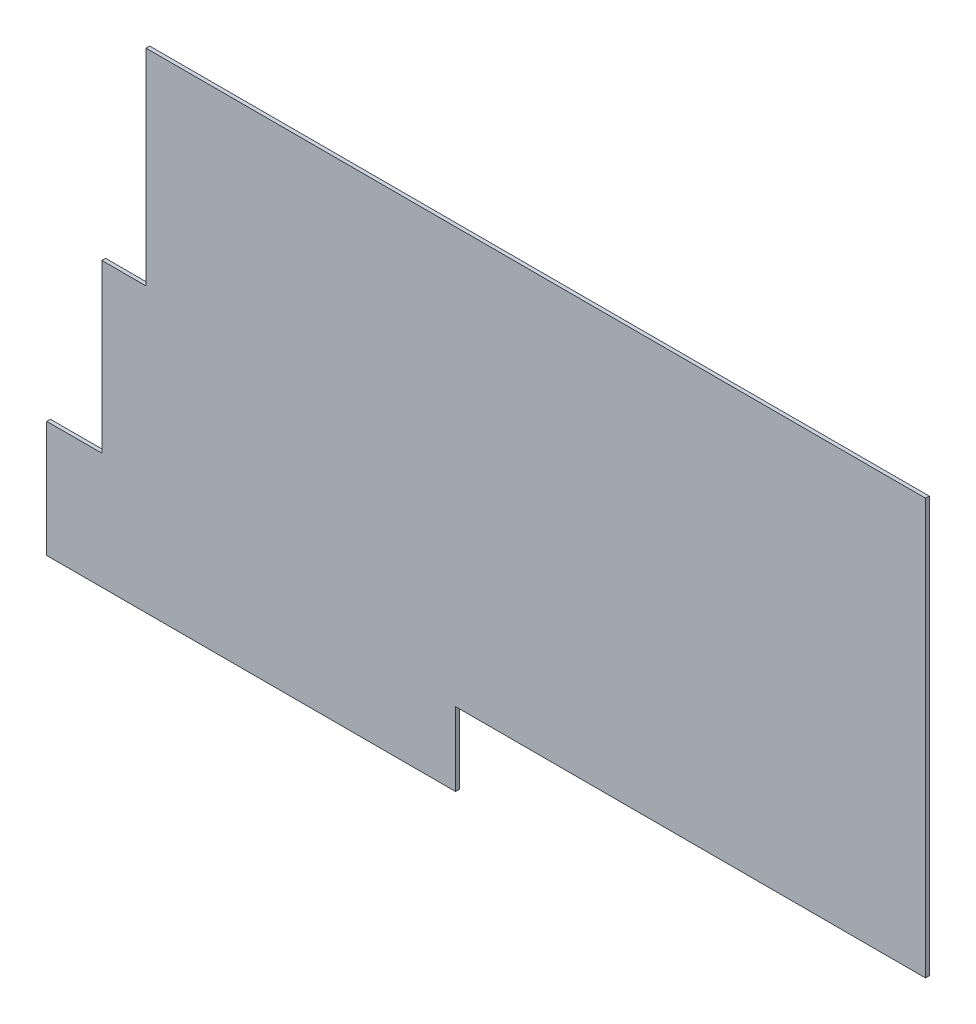
ISO-10303-21;
HEADER;
FILE_DESCRIPTION(('STEP AP214'),'2;1');
FILE_NAME('part.step','',(''),(''),'','','');
FILE_SCHEMA(('AUTOMOTIVE_DESIGN { 1 0 10303 214 1 1 1 1 }'));
ENDSEC;
DATA;
#1=APPLICATION_CONTEXT('core data for automotive mechanical design processes');
#2=APPLICATION_PROTOCOL_DEFINITION('international standard','automotive_design',2000,#1);
#3=PRODUCT_CONTEXT('',#1,'mechanical');
#4=PRODUCT('Part','Part','',(#3));
#5=PRODUCT_RELATED_PRODUCT_CATEGORY('part','',(#4));
#6=PRODUCT_DEFINITION_FORMATION('','',#4);
#7=PRODUCT_DEFINITION_CONTEXT('part definition',#1,'design');
#8=PRODUCT_DEFINITION('design','',#6,#7);
#9=PRODUCT_DEFINITION_SHAPE('','',#8);
#10=(LENGTH_UNIT() NAMED_UNIT(*) SI_UNIT(.MILLI.,.METRE.));
#11=(NAMED_UNIT(*) PLANE_ANGLE_UNIT() SI_UNIT($,.RADIAN.));
#12=(NAMED_UNIT(*) SI_UNIT($,.STERADIAN.) SOLID_ANGLE_UNIT());
#13=UNCERTAINTY_MEASURE_WITH_UNIT(LENGTH_MEASURE(1.E-05),#10,'distance_accuracy_value','');
#14=(GEOMETRIC_REPRESENTATION_CONTEXT(3) GLOBAL_UNCERTAINTY_ASSIGNED_CONTEXT((#13)) GLOBAL_UNIT_ASSIGNED_CONTEXT((#10,
#11,#12)) REPRESENTATION_CONTEXT('',''));
#15=CARTESIAN_POINT('',(0.,0.,0.));
#16=DIRECTION('',(0.,0.,1.));
#17=DIRECTION('',(1.,0.,0.));
#18=AXIS2_PLACEMENT_3D('',#15,#16,#17);
#19=CARTESIAN_POINT('',(-3420.,-2170.,50.));
#20=DIRECTION('',(1.,0.,0.));
#21=DIRECTION('',(0.,0.,-1.));
#22=AXIS2_PLACEMENT_3D('',#19,#20,#21);
#23=PLANE('',#22);
#24=DIRECTION('',(0.,-1.,0.));
#25=VECTOR('',#24,1.);
#26=CARTESIAN_POINT('',(-3420.,-2170.,0.));
#27=LINE('',#26,#25);
#28=CARTESIAN_POINT('',(-3420.,-2170.,0.));
#29=VERTEX_POINT('',#28);
#30=CARTESIAN_POINT('',(-3420.,-3750.,0.));
#31=VERTEX_POINT('',#30);
#32=EDGE_CURVE('E142',#29,#31,#27,.T.);
#33=ORIENTED_EDGE('',*,*,#32,.T.);
#34=DIRECTION('',(0.,0.,-1.));
#35=VECTOR('',#34,1.);
#36=CARTESIAN_POINT('',(-3420.,-3750.,50.));
#37=LINE('',#36,#35);
#38=CARTESIAN_POINT('',(-3420.,-3750.,50.));
#39=VERTEX_POINT('',#38);
#40=EDGE_CURVE('E11',#39,#31,#37,.T.);
#41=ORIENTED_EDGE('',*,*,#40,.F.);
#42=DIRECTION('',(0.,-1.,0.));
#43=VECTOR('',#42,1.);
#44=CARTESIAN_POINT('',(-3420.,-2170.,50.));
#45=LINE('',#44,#43);
#46=CARTESIAN_POINT('',(-3420.,-2170.,50.));
#47=VERTEX_POINT('',#46);
#48=EDGE_CURVE('E160',#47,#39,#45,.T.);
#49=ORIENTED_EDGE('',*,*,#48,.F.);
#50=DIRECTION('',(0.,0.,-1.));
#51=VECTOR('',#50,1.);
#52=CARTESIAN_POINT('',(-3420.,-2170.,50.));
#53=LINE('',#52,#51);
#54=EDGE_CURVE('E138',#47,#29,#53,.T.);
#55=ORIENTED_EDGE('',*,*,#54,.T.);
#56=EDGE_LOOP('',(#33,#41,#49,#55));
#57=FACE_BOUND('',#56,.T.);
#58=ADVANCED_FACE('F34',(#57),#23,.F.);
#59=CARTESIAN_POINT('',(-3420.,-3750.,50.));
#60=DIRECTION('',(0.,1.,0.));
#61=DIRECTION('',(0.,0.,1.));
#62=AXIS2_PLACEMENT_3D('',#59,#60,#61);
#63=PLANE('',#62);
#64=DIRECTION('',(1.,0.,0.));
#65=VECTOR('',#64,1.);
#66=CARTESIAN_POINT('',(-3420.,-3750.,0.));
#67=LINE('',#66,#65);
#68=CARTESIAN_POINT('',(2140.,-3750.,0.));
#69=VERTEX_POINT('',#68);
#70=EDGE_CURVE('E145',#31,#69,#67,.T.);
#71=ORIENTED_EDGE('',*,*,#70,.T.);
#72=DIRECTION('',(0.,0.,-1.));
#73=VECTOR('',#72,1.);
#74=CARTESIAN_POINT('',(2140.,-3750.,50.));
#75=LINE('',#74,#73);
#76=CARTESIAN_POINT('',(2140.,-3750.,50.));
#77=VERTEX_POINT('',#76);
#78=EDGE_CURVE('E42',#77,#69,#75,.T.);
#79=ORIENTED_EDGE('',*,*,#78,.F.);
#80=DIRECTION('',(1.,0.,0.));
#81=VECTOR('',#80,1.);
#82=CARTESIAN_POINT('',(-3420.,-3750.,50.));
#83=LINE('',#82,#81);
#84=EDGE_CURVE('E99',#39,#77,#83,.T.);
#85=ORIENTED_EDGE('',*,*,#84,.F.);
#86=ORIENTED_EDGE('',*,*,#40,.T.);
#87=EDGE_LOOP('',(#71,#79,#85,#86));
#88=FACE_BOUND('',#87,.T.);
#89=ADVANCED_FACE('F209',(#88),#63,.F.);
#90=CARTESIAN_POINT('',(2140.,-2750.,50.));
#91=DIRECTION('',(-1.,0.,0.));
#92=DIRECTION('',(0.,-1.,0.));
#93=AXIS2_PLACEMENT_3D('',#90,#91,#92);
#94=PLANE('',#93);
#95=DIRECTION('',(0.,1.,0.));
#96=VECTOR('',#95,1.);
#97=CARTESIAN_POINT('',(2140.,-2750.,0.));
#98=LINE('',#97,#96);
#99=CARTESIAN_POINT('',(2140.,-2750.,0.));
#100=VERTEX_POINT('',#99);
#101=EDGE_CURVE('E147',#69,#100,#98,.T.);
#102=ORIENTED_EDGE('',*,*,#101,.T.);
#103=DIRECTION('',(0.,0.,-1.));
#104=VECTOR('',#103,1.);
#105=CARTESIAN_POINT('',(2140.,-2750.,50.));
#106=LINE('',#105,#104);
#107=CARTESIAN_POINT('',(2140.,-2750.,50.));
#108=VERTEX_POINT('',#107);
#109=EDGE_CURVE('E173',#108,#100,#106,.T.);
#110=ORIENTED_EDGE('',*,*,#109,.F.);
#111=DIRECTION('',(0.,1.,0.));
#112=VECTOR('',#111,1.);
#113=CARTESIAN_POINT('',(2140.,-2750.,50.));
#114=LINE('',#113,#112);
#115=EDGE_CURVE('E181',#77,#108,#114,.T.);
#116=ORIENTED_EDGE('',*,*,#115,.F.);
#117=ORIENTED_EDGE('',*,*,#78,.T.);
#118=EDGE_LOOP('',(#102,#110,#116,#117));
#119=FACE_BOUND('',#118,.T.);
#120=ADVANCED_FACE('F179',(#119),#94,.F.);
#121=CARTESIAN_POINT('',(8530.,-2750.,50.));
#122=DIRECTION('',(0.,1.,0.));
#123=DIRECTION('',(-1.,0.,0.));
#124=AXIS2_PLACEMENT_3D('',#121,#122,#123);
#125=PLANE('',#124);
#126=DIRECTION('',(1.,0.,0.));
#127=VECTOR('',#126,1.);
#128=CARTESIAN_POINT('',(8530.,-2750.,0.));
#129=LINE('',#128,#127);
#130=CARTESIAN_POINT('',(8530.,-2750.,0.));
#131=VERTEX_POINT('',#130);
#132=EDGE_CURVE('E149',#100,#131,#129,.T.);
#133=ORIENTED_EDGE('',*,*,#132,.T.);
#134=DIRECTION('',(0.,0.,-1.));
#135=VECTOR('',#134,1.);
#136=CARTESIAN_POINT('',(8530.,-2750.,50.));
#137=LINE('',#136,#135);
#138=CARTESIAN_POINT('',(8530.,-2750.,50.));
#139=VERTEX_POINT('',#138);
#140=EDGE_CURVE('E170',#139,#131,#137,.T.);
#141=ORIENTED_EDGE('',*,*,#140,.F.);
#142=DIRECTION('',(1.,0.,0.));
#143=VECTOR('',#142,1.);
#144=CARTESIAN_POINT('',(8530.,-2750.,50.));
#145=LINE('',#144,#143);
#146=EDGE_CURVE('E199',#108,#139,#145,.T.);
#147=ORIENTED_EDGE('',*,*,#146,.F.);
#148=ORIENTED_EDGE('',*,*,#109,.T.);
#149=EDGE_LOOP('',(#133,#141,#147,#148));
#150=FACE_BOUND('',#149,.T.);
#151=ADVANCED_FACE('F190',(#150),#125,.F.);
#152=CARTESIAN_POINT('',(8530.,2900.,50.));
#153=DIRECTION('',(-1.,0.,0.));
#154=DIRECTION('',(0.,-1.,0.));
#155=AXIS2_PLACEMENT_3D('',#152,#153,#154);
#156=PLANE('',#155);
#157=DIRECTION('',(0.,1.,0.));
#158=VECTOR('',#157,1.);
#159=CARTESIAN_POINT('',(8530.,2900.,0.));
#160=LINE('',#159,#158);
#161=CARTESIAN_POINT('',(8530.,2900.,0.));
#162=VERTEX_POINT('',#161);
#163=EDGE_CURVE('E151',#131,#162,#160,.T.);
#164=ORIENTED_EDGE('',*,*,#163,.T.);
#165=DIRECTION('',(0.,0.,-1.));
#166=VECTOR('',#165,1.);
#167=CARTESIAN_POINT('',(8530.,2900.,50.));
#168=LINE('',#167,#166);
#169=CARTESIAN_POINT('',(8530.,2900.,50.));
#170=VERTEX_POINT('',#169);
#171=EDGE_CURVE('E167',#170,#162,#168,.T.);
#172=ORIENTED_EDGE('',*,*,#171,.F.);
#173=DIRECTION('',(0.,1.,0.));
#174=VECTOR('',#173,1.);
#175=CARTESIAN_POINT('',(8530.,2900.,50.));
#176=LINE('',#175,#174);
#177=EDGE_CURVE('E196',#139,#170,#176,.T.);
#178=ORIENTED_EDGE('',*,*,#177,.F.);
#179=ORIENTED_EDGE('',*,*,#140,.T.);
#180=EDGE_LOOP('',(#164,#172,#178,#179));
#181=FACE_BOUND('',#180,.T.);
#182=ADVANCED_FACE('F194',(#181),#156,.F.);
#183=CARTESIAN_POINT('',(-2070.,2900.,50.));
#184=DIRECTION('',(0.,-1.,0.));
#185=DIRECTION('',(1.,0.,0.));
#186=AXIS2_PLACEMENT_3D('',#183,#184,#185);
#187=PLANE('',#186);
#188=DIRECTION('',(-1.,0.,0.));
#189=VECTOR('',#188,1.);
#190=CARTESIAN_POINT('',(-2070.,2900.,0.));
#191=LINE('',#190,#189);
#192=CARTESIAN_POINT('',(-2070.,2900.,0.));
#193=VERTEX_POINT('',#192);
#194=EDGE_CURVE('E153',#162,#193,#191,.T.);
#195=ORIENTED_EDGE('',*,*,#194,.T.);
#196=DIRECTION('',(0.,0.,-1.));
#197=VECTOR('',#196,1.);
#198=CARTESIAN_POINT('',(-2070.,2900.,50.));
#199=LINE('',#198,#197);
#200=CARTESIAN_POINT('',(-2070.,2900.,50.));
#201=VERTEX_POINT('',#200);
#202=EDGE_CURVE('E164',#201,#193,#199,.T.);
#203=ORIENTED_EDGE('',*,*,#202,.F.);
#204=DIRECTION('',(-1.,0.,0.));
#205=VECTOR('',#204,1.);
#206=CARTESIAN_POINT('',(-2070.,2900.,50.));
#207=LINE('',#206,#205);
#208=EDGE_CURVE('E198',#170,#201,#207,.T.);
#209=ORIENTED_EDGE('',*,*,#208,.F.);
#210=ORIENTED_EDGE('',*,*,#171,.T.);
#211=EDGE_LOOP('',(#195,#203,#209,#210));
#212=FACE_BOUND('',#211,.T.);
#213=ADVANCED_FACE('F221',(#212),#187,.F.);
#214=CARTESIAN_POINT('',(-2070.,2900.,50.));
#215=DIRECTION('',(1.,0.,0.));
#216=DIRECTION('',(0.,1.,0.));
#217=AXIS2_PLACEMENT_3D('',#214,#215,#216);
#218=PLANE('',#217);
#219=DIRECTION('',(0.,-1.,0.));
#220=VECTOR('',#219,1.);
#221=CARTESIAN_POINT('',(-2070.,2900.,0.));
#222=LINE('',#221,#220);
#223=CARTESIAN_POINT('',(-2070.,100.000000000001,0.));
#224=VERTEX_POINT('',#223);
#225=EDGE_CURVE('E155',#193,#224,#222,.T.);
#226=ORIENTED_EDGE('',*,*,#225,.T.);
#227=DIRECTION('',(0.,0.,-1.));
#228=VECTOR('',#227,1.);
#229=CARTESIAN_POINT('',(-2070.,100.000000000001,50.));
#230=LINE('',#229,#228);
#231=CARTESIAN_POINT('',(-2070.,100.000000000001,50.));
#232=VERTEX_POINT('',#231);
#233=EDGE_CURVE('E133',#232,#224,#230,.T.);
#234=ORIENTED_EDGE('',*,*,#233,.F.);
#235=DIRECTION('',(0.,-1.,0.));
#236=VECTOR('',#235,1.);
#237=CARTESIAN_POINT('',(-2070.,2900.,50.));
#238=LINE('',#237,#236);
#239=EDGE_CURVE('E124',#201,#232,#238,.T.);
#240=ORIENTED_EDGE('',*,*,#239,.F.);
#241=ORIENTED_EDGE('',*,*,#202,.T.);
#242=EDGE_LOOP('',(#226,#234,#240,#241));
#243=FACE_BOUND('',#242,.T.);
#244=ADVANCED_FACE('F224',(#243),#218,.F.);
#245=CARTESIAN_POINT('',(-2070.,100.000000000001,50.));
#246=DIRECTION('',(0.,-1.,0.));
#247=DIRECTION('',(1.,0.,0.));
#248=AXIS2_PLACEMENT_3D('',#245,#246,#247);
#249=PLANE('',#248);
#250=DIRECTION('',(-1.,0.,0.));
#251=VECTOR('',#250,1.);
#252=CARTESIAN_POINT('',(-2070.,100.000000000001,0.));
#253=LINE('',#252,#251);
#254=CARTESIAN_POINT('',(-2670.,100.,0.));
#255=VERTEX_POINT('',#254);
#256=EDGE_CURVE('E132',#224,#255,#253,.T.);
#257=ORIENTED_EDGE('',*,*,#256,.T.);
#258=DIRECTION('',(0.,0.,-1.));
#259=VECTOR('',#258,1.);
#260=CARTESIAN_POINT('',(-2670.,100.,50.));
#261=LINE('',#260,#259);
#262=CARTESIAN_POINT('',(-2670.,100.,50.));
#263=VERTEX_POINT('',#262);
#264=EDGE_CURVE('E129',#263,#255,#261,.T.);
#265=ORIENTED_EDGE('',*,*,#264,.F.);
#266=DIRECTION('',(-1.,0.,0.));
#267=VECTOR('',#266,1.);
#268=CARTESIAN_POINT('',(-2070.,100.000000000001,50.));
#269=LINE('',#268,#267);
#270=EDGE_CURVE('E118',#232,#263,#269,.T.);
#271=ORIENTED_EDGE('',*,*,#270,.F.);
#272=ORIENTED_EDGE('',*,*,#233,.T.);
#273=EDGE_LOOP('',(#257,#265,#271,#272));
#274=FACE_BOUND('',#273,.T.);
#275=ADVANCED_FACE('F130',(#274),#249,.F.);
#276=CARTESIAN_POINT('',(-2670.,100.,50.));
#277=DIRECTION('',(1.,0.,0.));
#278=DIRECTION('',(0.,1.,0.));
#279=AXIS2_PLACEMENT_3D('',#276,#277,#278);
#280=PLANE('',#279);
#281=DIRECTION('',(0.,-1.,0.));
#282=VECTOR('',#281,1.);
#283=CARTESIAN_POINT('',(-2670.,100.,0.));
#284=LINE('',#283,#282);
#285=CARTESIAN_POINT('',(-2670.,-2170.,0.));
#286=VERTEX_POINT('',#285);
#287=EDGE_CURVE('E85',#255,#286,#284,.T.);
#288=ORIENTED_EDGE('',*,*,#287,.T.);
#289=DIRECTION('',(0.,0.,-1.));
#290=VECTOR('',#289,1.);
#291=CARTESIAN_POINT('',(-2670.,-2170.,50.));
#292=LINE('',#291,#290);
#293=CARTESIAN_POINT('',(-2670.,-2170.,50.));
#294=VERTEX_POINT('',#293);
#295=EDGE_CURVE('E134',#294,#286,#292,.T.);
#296=ORIENTED_EDGE('',*,*,#295,.F.);
#297=DIRECTION('',(0.,-1.,0.));
#298=VECTOR('',#297,1.);
#299=CARTESIAN_POINT('',(-2670.,100.,50.));
#300=LINE('',#299,#298);
#301=EDGE_CURVE('E122',#263,#294,#300,.T.);
#302=ORIENTED_EDGE('',*,*,#301,.F.);
#303=ORIENTED_EDGE('',*,*,#264,.T.);
#304=EDGE_LOOP('',(#288,#296,#302,#303));
#305=FACE_BOUND('',#304,.T.);
#306=ADVANCED_FACE('F136',(#305),#280,.F.);
#307=CARTESIAN_POINT('',(-2670.,-2170.,50.));
#308=DIRECTION('',(0.,-1.,0.));
#309=DIRECTION('',(0.,0.,-1.));
#310=AXIS2_PLACEMENT_3D('',#307,#308,#309);
#311=PLANE('',#310);
#312=DIRECTION('',(-1.,0.,0.));
#313=VECTOR('',#312,1.);
#314=CARTESIAN_POINT('',(-2670.,-2170.,0.));
#315=LINE('',#314,#313);
#316=EDGE_CURVE('E91',#286,#29,#315,.T.);
#317=ORIENTED_EDGE('',*,*,#316,.T.);
#318=ORIENTED_EDGE('',*,*,#54,.F.);
#319=DIRECTION('',(-1.,0.,0.));
#320=VECTOR('',#319,1.);
#321=CARTESIAN_POINT('',(-2670.,-2170.,50.));
#322=LINE('',#321,#320);
#323=EDGE_CURVE('E50',#294,#47,#322,.T.);
#324=ORIENTED_EDGE('',*,*,#323,.F.);
#325=ORIENTED_EDGE('',*,*,#295,.T.);
#326=EDGE_LOOP('',(#317,#318,#324,#325));
#327=FACE_BOUND('',#326,.T.);
#328=ADVANCED_FACE('F233',(#327),#311,.F.);
#329=CARTESIAN_POINT('',(-3420.,-3750.,50.));
#330=DIRECTION('',(0.,0.,1.));
#331=DIRECTION('',(1.,0.,0.));
#332=AXIS2_PLACEMENT_3D('',#329,#330,#331);
#333=PLANE('',#332);
#334=ORIENTED_EDGE('',*,*,#48,.T.);
#335=ORIENTED_EDGE('',*,*,#84,.T.);
#336=ORIENTED_EDGE('',*,*,#115,.T.);
#337=ORIENTED_EDGE('',*,*,#146,.T.);
#338=ORIENTED_EDGE('',*,*,#177,.T.);
#339=ORIENTED_EDGE('',*,*,#208,.T.);
#340=ORIENTED_EDGE('',*,*,#239,.T.);
#341=ORIENTED_EDGE('',*,*,#270,.T.);
#342=ORIENTED_EDGE('',*,*,#301,.T.);
#343=ORIENTED_EDGE('',*,*,#323,.T.);
#344=EDGE_LOOP('',(#334,#335,#336,#337,#338,#339,#340,#341,#342,#343));
#345=FACE_BOUND('',#344,.T.);
#346=ADVANCED_FACE('F120',(#345),#333,.T.);
#347=CARTESIAN_POINT('',(-3420.,-3750.,0.));
#348=DIRECTION('',(0.,0.,1.));
#349=DIRECTION('',(1.,0.,0.));
#350=AXIS2_PLACEMENT_3D('',#347,#348,#349);
#351=PLANE('',#350);
#352=ORIENTED_EDGE('',*,*,#32,.F.);
#353=ORIENTED_EDGE('',*,*,#316,.F.);
#354=ORIENTED_EDGE('',*,*,#287,.F.);
#355=ORIENTED_EDGE('',*,*,#256,.F.);
#356=ORIENTED_EDGE('',*,*,#225,.F.);
#357=ORIENTED_EDGE('',*,*,#194,.F.);
#358=ORIENTED_EDGE('',*,*,#163,.F.);
#359=ORIENTED_EDGE('',*,*,#132,.F.);
#360=ORIENTED_EDGE('',*,*,#101,.F.);
#361=ORIENTED_EDGE('',*,*,#70,.F.);
#362=EDGE_LOOP('',(#352,#353,#354,#355,#356,#357,#358,#359,#360,#361));
#363=FACE_BOUND('',#362,.T.);
#364=ADVANCED_FACE('F185',(#363),#351,.F.);
#365=CLOSED_SHELL('',(#58,#89,#120,#151,#182,#213,#244,#275,#306,#328,#346,#364));
#366=MANIFOLD_SOLID_BREP('B2',#365);
#367=ADVANCED_BREP_SHAPE_REPRESENTATION('',(#18,#366),#14);
#368=SHAPE_DEFINITION_REPRESENTATION(#9,#367);
ENDSEC;
END-ISO-10303-21;
